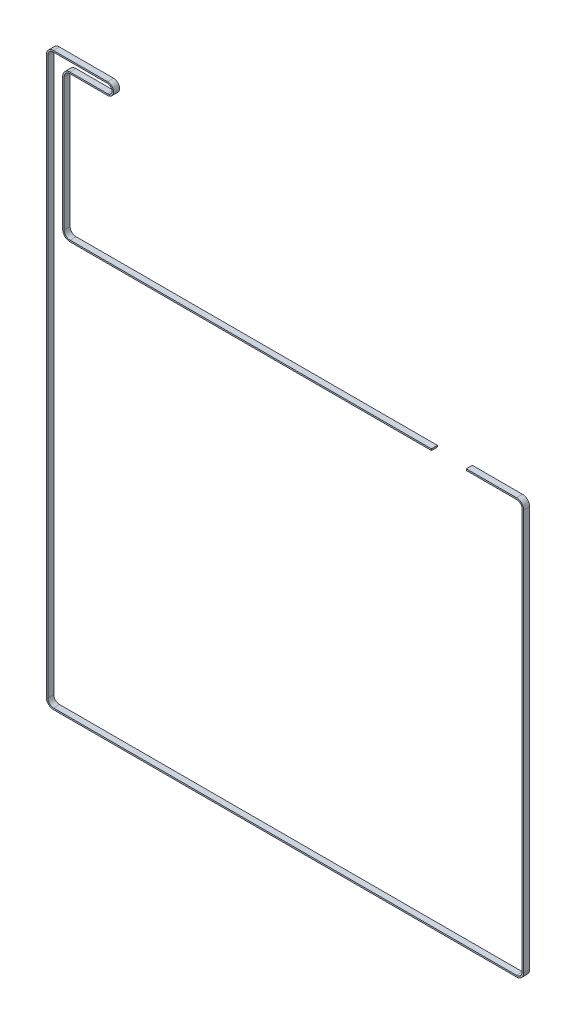
ISO-10303-21;
HEADER;
FILE_DESCRIPTION(('STEP AP214'),'2;1');
FILE_NAME('part.step','',(''),(''),'','','');
FILE_SCHEMA(('AUTOMOTIVE_DESIGN { 1 0 10303 214 1 1 1 1 }'));
ENDSEC;
DATA;
#1=APPLICATION_CONTEXT('core data for automotive mechanical design processes');
#2=APPLICATION_PROTOCOL_DEFINITION('international standard','automotive_design',2000,#1);
#3=PRODUCT_CONTEXT('',#1,'mechanical');
#4=PRODUCT('Part','Part','',(#3));
#5=PRODUCT_RELATED_PRODUCT_CATEGORY('part','',(#4));
#6=PRODUCT_DEFINITION_FORMATION('','',#4);
#7=PRODUCT_DEFINITION_CONTEXT('part definition',#1,'design');
#8=PRODUCT_DEFINITION('design','',#6,#7);
#9=PRODUCT_DEFINITION_SHAPE('','',#8);
#10=(LENGTH_UNIT() NAMED_UNIT(*) SI_UNIT(.MILLI.,.METRE.));
#11=(NAMED_UNIT(*) PLANE_ANGLE_UNIT() SI_UNIT($,.RADIAN.));
#12=(NAMED_UNIT(*) SI_UNIT($,.STERADIAN.) SOLID_ANGLE_UNIT());
#13=UNCERTAINTY_MEASURE_WITH_UNIT(LENGTH_MEASURE(1.E-05),#10,'distance_accuracy_value','');
#14=(GEOMETRIC_REPRESENTATION_CONTEXT(3) GLOBAL_UNCERTAINTY_ASSIGNED_CONTEXT((#13)) GLOBAL_UNIT_ASSIGNED_CONTEXT((#10,
#11,#12)) REPRESENTATION_CONTEXT('',''));
#15=CARTESIAN_POINT('',(0.,0.,0.));
#16=DIRECTION('',(0.,0.,1.));
#17=DIRECTION('',(1.,0.,0.));
#18=AXIS2_PLACEMENT_3D('',#15,#16,#17);
#19=CARTESIAN_POINT('',(370.637232088485,-0.149999999965927,0.));
#20=DIRECTION('',(-1.,0.,0.));
#21=DIRECTION('',(0.,0.,1.));
#22=AXIS2_PLACEMENT_3D('',#19,#20,#21);
#23=PLANE('',#22);
#24=DIRECTION('',(0.,0.,1.));
#25=VECTOR('',#24,1.);
#26=CARTESIAN_POINT('',(370.637232088485,-103.690118889299,1.45000000000001));
#27=LINE('',#26,#25);
#28=CARTESIAN_POINT('',(370.637232088485,-103.690118889299,1.45000000000001));
#29=VERTEX_POINT('',#28);
#30=CARTESIAN_POINT('',(370.637232088485,-103.690118889299,7.45000000000001));
#31=VERTEX_POINT('',#30);
#32=EDGE_CURVE('E211',#29,#31,#27,.T.);
#33=ORIENTED_EDGE('',*,*,#32,.F.);
#34=DIRECTION('',(0.,1.,0.));
#35=VECTOR('',#34,1.);
#36=CARTESIAN_POINT('',(370.637232088485,-0.149999999965927,1.45000000000001));
#37=LINE('',#36,#35);
#38=CARTESIAN_POINT('',(370.637232088485,-102.190118889299,1.45000000000001));
#39=VERTEX_POINT('',#38);
#40=EDGE_CURVE('E262',#39,#29,#37,.F.);
#41=ORIENTED_EDGE('',*,*,#40,.F.);
#42=DIRECTION('',(0.,0.,1.));
#43=VECTOR('',#42,1.);
#44=CARTESIAN_POINT('',(370.637232088485,-102.190118889299,1.45000000000001));
#45=LINE('',#44,#43);
#46=CARTESIAN_POINT('',(370.637232088485,-102.190118889299,7.45000000000001));
#47=VERTEX_POINT('',#46);
#48=EDGE_CURVE('E251',#47,#39,#45,.F.);
#49=ORIENTED_EDGE('',*,*,#48,.F.);
#50=DIRECTION('',(0.,1.,0.));
#51=VECTOR('',#50,1.);
#52=CARTESIAN_POINT('',(370.637232088485,-0.149999999965927,7.45000000000001));
#53=LINE('',#52,#51);
#54=EDGE_CURVE('E252',#31,#47,#53,.T.);
#55=ORIENTED_EDGE('',*,*,#54,.F.);
#56=EDGE_LOOP('',(#33,#41,#49,#55));
#57=FACE_BOUND('',#56,.T.);
#58=ADVANCED_FACE('F17',(#57),#23,.F.);
#59=CARTESIAN_POINT('',(370.637232088485,-102.190118889299,1.45000000000001));
#60=DIRECTION('',(0.,1.,0.));
#61=DIRECTION('',(-1.,0.,0.));
#62=AXIS2_PLACEMENT_3D('',#59,#60,#61);
#63=PLANE('',#62);
#64=ORIENTED_EDGE('',*,*,#48,.T.);
#65=DIRECTION('',(-1.,0.,0.));
#66=VECTOR('',#65,1.);
#67=CARTESIAN_POINT('',(370.637232088485,-102.190118889299,1.45000000000001));
#68=LINE('',#67,#66);
#69=CARTESIAN_POINT('',(10.0000000000049,-102.190118889256,1.45000000000001));
#70=VERTEX_POINT('',#69);
#71=EDGE_CURVE('E243',#39,#70,#68,.T.);
#72=ORIENTED_EDGE('',*,*,#71,.T.);
#73=DIRECTION('',(0.,0.,-1.));
#74=VECTOR('',#73,1.);
#75=CARTESIAN_POINT('',(10.0000000000084,-102.190118889211,4.45000000000001));
#76=LINE('',#75,#74);
#77=CARTESIAN_POINT('',(10.0000000000049,-102.190118889256,7.45000000000001));
#78=VERTEX_POINT('',#77);
#79=EDGE_CURVE('E208',#70,#78,#76,.F.);
#80=ORIENTED_EDGE('',*,*,#79,.T.);
#81=DIRECTION('',(-1.,0.,0.));
#82=VECTOR('',#81,1.);
#83=CARTESIAN_POINT('',(370.637232088485,-102.190118889299,7.45000000000001));
#84=LINE('',#83,#82);
#85=EDGE_CURVE('E248',#78,#47,#84,.F.);
#86=ORIENTED_EDGE('',*,*,#85,.T.);
#87=EDGE_LOOP('',(#64,#72,#80,#86));
#88=FACE_BOUND('',#87,.T.);
#89=ADVANCED_FACE('F375',(#88),#63,.T.);
#90=CARTESIAN_POINT('',(370.637232088485,-103.690118889299,1.45000000000001));
#91=DIRECTION('',(0.,-1.,0.));
#92=DIRECTION('',(1.,0.,0.));
#93=AXIS2_PLACEMENT_3D('',#90,#91,#92);
#94=PLANE('',#93);
#95=DIRECTION('',(1.,0.,0.));
#96=VECTOR('',#95,1.);
#97=CARTESIAN_POINT('',(370.637232088485,-103.690118889299,1.45000000000001));
#98=LINE('',#97,#96);
#99=CARTESIAN_POINT('',(10.0000000000049,-103.690118889256,1.45000000000001));
#100=VERTEX_POINT('',#99);
#101=EDGE_CURVE('E235',#100,#29,#98,.T.);
#102=ORIENTED_EDGE('',*,*,#101,.T.);
#103=ORIENTED_EDGE('',*,*,#32,.T.);
#104=DIRECTION('',(1.,0.,0.));
#105=VECTOR('',#104,1.);
#106=CARTESIAN_POINT('',(370.637232088485,-103.690118889299,7.45000000000001));
#107=LINE('',#106,#105);
#108=CARTESIAN_POINT('',(10.0000000000049,-103.690118889256,7.45000000000001));
#109=VERTEX_POINT('',#108);
#110=EDGE_CURVE('E238',#31,#109,#107,.F.);
#111=ORIENTED_EDGE('',*,*,#110,.T.);
#112=DIRECTION('',(0.,0.,-1.));
#113=VECTOR('',#112,1.);
#114=CARTESIAN_POINT('',(10.0000000000084,-103.690118889211,4.45000000000001));
#115=LINE('',#114,#113);
#116=EDGE_CURVE('E226',#100,#109,#115,.F.);
#117=ORIENTED_EDGE('',*,*,#116,.F.);
#118=EDGE_LOOP('',(#102,#103,#111,#117));
#119=FACE_BOUND('',#118,.T.);
#120=ADVANCED_FACE('F590',(#119),#94,.T.);
#121=CARTESIAN_POINT('',(10.0000000000014,-96.3401188893325,4.45000000000001));
#122=DIRECTION('',(0.,0.,-1.));
#123=DIRECTION('',(-1.,0.,0.));
#124=AXIS2_PLACEMENT_3D('',#121,#122,#123);
#125=CYLINDRICAL_SURFACE('',#124,5.84999999987856);
#126=CARTESIAN_POINT('',(10.0000000000014,-96.3401188893325,7.45000000000001));
#127=DIRECTION('',(0.,0.,-1.));
#128=DIRECTION('',(-1.,0.,0.));
#129=AXIS2_PLACEMENT_3D('',#126,#127,#128);
#130=CIRCLE('',#129,5.84999999987856);
#131=CARTESIAN_POINT('',(4.15000000006143,-96.3401188893325,7.45000000000001));
#132=VERTEX_POINT('',#131);
#133=EDGE_CURVE('E247',#78,#132,#130,.T.);
#134=ORIENTED_EDGE('',*,*,#133,.F.);
#135=ORIENTED_EDGE('',*,*,#79,.F.);
#136=CARTESIAN_POINT('',(10.0000000000014,-96.3401188893325,1.45000000000001));
#137=DIRECTION('',(0.,0.,-1.));
#138=DIRECTION('',(-1.,0.,0.));
#139=AXIS2_PLACEMENT_3D('',#136,#137,#138);
#140=CIRCLE('',#139,5.84999999987856);
#141=CARTESIAN_POINT('',(4.15000000006143,-96.3401188893326,1.45000000000001));
#142=VERTEX_POINT('',#141);
#143=EDGE_CURVE('E20',#142,#70,#140,.F.);
#144=ORIENTED_EDGE('',*,*,#143,.F.);
#145=DIRECTION('',(0.,0.,1.));
#146=VECTOR('',#145,1.);
#147=CARTESIAN_POINT('',(4.14999999999999,-96.3401188893326,1.45000000000001));
#148=LINE('',#147,#146);
#149=EDGE_CURVE('E205',#132,#142,#148,.F.);
#150=ORIENTED_EDGE('',*,*,#149,.F.);
#151=EDGE_LOOP('',(#134,#135,#144,#150));
#152=FACE_BOUND('',#151,.T.);
#153=ADVANCED_FACE('F203',(#152),#125,.F.);
#154=CARTESIAN_POINT('',(455.499999999999,-102.040118889329,1.45000000000001));
#155=DIRECTION('',(0.,1.,0.));
#156=DIRECTION('',(-1.,0.,0.));
#157=AXIS2_PLACEMENT_3D('',#154,#155,#156);
#158=PLANE('',#157);
#159=DIRECTION('',(0.,0.,1.));
#160=VECTOR('',#159,1.);
#161=CARTESIAN_POINT('',(455.50000000001,-102.04011888933,4.45000000000001));
#162=LINE('',#161,#160);
#163=CARTESIAN_POINT('',(455.500000000004,-102.040118889332,1.45000000000001));
#164=VERTEX_POINT('',#163);
#165=CARTESIAN_POINT('',(455.500000000004,-102.04011888933,7.45000000000001));
#166=VERTEX_POINT('',#165);
#167=EDGE_CURVE('E508',#164,#166,#162,.T.);
#168=ORIENTED_EDGE('',*,*,#167,.F.);
#169=DIRECTION('',(-1.,0.,0.));
#170=VECTOR('',#169,1.);
#171=CARTESIAN_POINT('',(455.499999999999,-102.040118889333,1.45000000000001));
#172=LINE('',#171,#170);
#173=CARTESIAN_POINT('',(405.337232088476,-102.040118889333,1.45000000000001));
#174=VERTEX_POINT('',#173);
#175=EDGE_CURVE('E511',#174,#164,#172,.F.);
#176=ORIENTED_EDGE('',*,*,#175,.F.);
#177=DIRECTION('',(0.,0.,1.));
#178=VECTOR('',#177,1.);
#179=CARTESIAN_POINT('',(405.337232088476,-102.040118889333,0.));
#180=LINE('',#179,#178);
#181=CARTESIAN_POINT('',(405.337232088476,-102.040118889332,7.45000000000001));
#182=VERTEX_POINT('',#181);
#183=EDGE_CURVE('E515',#182,#174,#180,.F.);
#184=ORIENTED_EDGE('',*,*,#183,.F.);
#185=DIRECTION('',(1.,0.,0.));
#186=VECTOR('',#185,1.);
#187=CARTESIAN_POINT('',(455.499999999999,-102.04011888933,7.45000000000001));
#188=LINE('',#187,#186);
#189=EDGE_CURVE('E221',#166,#182,#188,.F.);
#190=ORIENTED_EDGE('',*,*,#189,.F.);
#191=EDGE_LOOP('',(#168,#176,#184,#190));
#192=FACE_BOUND('',#191,.T.);
#193=ADVANCED_FACE('F544',(#192),#158,.T.);
#194=CARTESIAN_POINT('',(10.0000000000014,-96.3401188893325,4.45000000000001));
#195=DIRECTION('',(0.,0.,-1.));
#196=DIRECTION('',(-1.,0.,0.));
#197=AXIS2_PLACEMENT_3D('',#194,#195,#196);
#198=CYLINDRICAL_SURFACE('',#197,7.34999999987856);
#199=CARTESIAN_POINT('',(10.0000000000014,-96.3401188893325,1.45000000000001));
#200=DIRECTION('',(0.,0.,-1.));
#201=DIRECTION('',(-1.,0.,0.));
#202=AXIS2_PLACEMENT_3D('',#199,#200,#201);
#203=CIRCLE('',#202,7.34999999987856);
#204=CARTESIAN_POINT('',(2.65000000006142,-96.3401188893325,1.45000000000001));
#205=VERTEX_POINT('',#204);
#206=EDGE_CURVE('E234',#205,#100,#203,.F.);
#207=ORIENTED_EDGE('',*,*,#206,.T.);
#208=ORIENTED_EDGE('',*,*,#116,.T.);
#209=CARTESIAN_POINT('',(10.0000000000014,-96.3401188893325,7.45000000000001));
#210=DIRECTION('',(0.,0.,-1.));
#211=DIRECTION('',(-1.,0.,0.));
#212=AXIS2_PLACEMENT_3D('',#209,#210,#211);
#213=CIRCLE('',#212,7.34999999987856);
#214=CARTESIAN_POINT('',(2.65000000006142,-96.3401188893325,7.45000000000001));
#215=VERTEX_POINT('',#214);
#216=EDGE_CURVE('E365',#109,#215,#213,.T.);
#217=ORIENTED_EDGE('',*,*,#216,.T.);
#218=DIRECTION('',(0.,0.,1.));
#219=VECTOR('',#218,1.);
#220=CARTESIAN_POINT('',(2.64999999999999,-96.3401188893325,1.45000000000001));
#221=LINE('',#220,#219);
#222=EDGE_CURVE('E362',#205,#215,#221,.T.);
#223=ORIENTED_EDGE('',*,*,#222,.F.);
#224=EDGE_LOOP('',(#207,#208,#217,#223));
#225=FACE_BOUND('',#224,.T.);
#226=ADVANCED_FACE('F587',(#225),#198,.T.);
#227=CARTESIAN_POINT('',(4.14999999999999,-96.3401188893326,1.45000000000001));
#228=DIRECTION('',(1.,0.,0.));
#229=DIRECTION('',(0.,1.,0.));
#230=AXIS2_PLACEMENT_3D('',#227,#228,#229);
#231=PLANE('',#230);
#232=ORIENTED_EDGE('',*,*,#149,.T.);
#233=DIRECTION('',(0.,1.,0.));
#234=VECTOR('',#233,1.);
#235=CARTESIAN_POINT('',(4.14999999999999,-96.3401188893326,1.45000000000001));
#236=LINE('',#235,#234);
#237=CARTESIAN_POINT('',(4.14999999999998,35.6999999999999,1.45000000000001));
#238=VERTEX_POINT('',#237);
#239=EDGE_CURVE('E213',#142,#238,#236,.T.);
#240=ORIENTED_EDGE('',*,*,#239,.T.);
#241=DIRECTION('',(0.,0.,-1.));
#242=VECTOR('',#241,1.);
#243=CARTESIAN_POINT('',(4.14999999999997,35.6999999999999,4.45000000000001));
#244=LINE('',#243,#242);
#245=CARTESIAN_POINT('',(4.14999999999998,35.6999999999999,7.45000000000001));
#246=VERTEX_POINT('',#245);
#247=EDGE_CURVE('E360',#238,#246,#244,.F.);
#248=ORIENTED_EDGE('',*,*,#247,.T.);
#249=DIRECTION('',(0.,1.,0.));
#250=VECTOR('',#249,1.);
#251=CARTESIAN_POINT('',(4.14999999999999,-96.3401188893326,7.45000000000001));
#252=LINE('',#251,#250);
#253=EDGE_CURVE('E224',#246,#132,#252,.F.);
#254=ORIENTED_EDGE('',*,*,#253,.T.);
#255=EDGE_LOOP('',(#232,#240,#248,#254));
#256=FACE_BOUND('',#255,.T.);
#257=ADVANCED_FACE('F223',(#256),#231,.T.);
#258=CARTESIAN_POINT('',(405.337232088476,0.,0.));
#259=DIRECTION('',(-1.,0.,0.));
#260=DIRECTION('',(0.,0.,1.));
#261=AXIS2_PLACEMENT_3D('',#258,#259,#260);
#262=PLANE('',#261);
#263=DIRECTION('',(0.,1.,0.));
#264=VECTOR('',#263,1.);
#265=CARTESIAN_POINT('',(405.337232088476,-102.040118889329,1.45000000000001));
#266=LINE('',#265,#264);
#267=CARTESIAN_POINT('',(405.337232088476,-103.540118889333,1.45000000000001));
#268=VERTEX_POINT('',#267);
#269=EDGE_CURVE('E512',#268,#174,#266,.T.);
#270=ORIENTED_EDGE('',*,*,#269,.F.);
#271=DIRECTION('',(0.,0.,1.));
#272=VECTOR('',#271,1.);
#273=CARTESIAN_POINT('',(405.337232088476,-103.540118889333,1.45000000000001));
#274=LINE('',#273,#272);
#275=CARTESIAN_POINT('',(405.337232088476,-103.540118889333,7.45000000000001));
#276=VERTEX_POINT('',#275);
#277=EDGE_CURVE('E489',#276,#268,#274,.F.);
#278=ORIENTED_EDGE('',*,*,#277,.F.);
#279=DIRECTION('',(0.,1.,0.));
#280=VECTOR('',#279,1.);
#281=CARTESIAN_POINT('',(405.337232088476,0.,7.45000000000001));
#282=LINE('',#281,#280);
#283=EDGE_CURVE('E522',#276,#182,#282,.T.);
#284=ORIENTED_EDGE('',*,*,#283,.T.);
#285=ORIENTED_EDGE('',*,*,#183,.T.);
#286=EDGE_LOOP('',(#270,#278,#284,#285));
#287=FACE_BOUND('',#286,.T.);
#288=ADVANCED_FACE('F547',(#287),#262,.T.);
#289=CARTESIAN_POINT('',(455.499999999999,-109.165118889329,4.45000000000001));
#290=DIRECTION('',(0.,0.,1.));
#291=DIRECTION('',(1.,0.,0.));
#292=AXIS2_PLACEMENT_3D('',#289,#290,#291);
#293=CYLINDRICAL_SURFACE('',#292,7.12499999999938);
#294=DIRECTION('',(0.,0.,1.));
#295=VECTOR('',#294,1.);
#296=CARTESIAN_POINT('',(462.624999999997,-109.165118889328,1.45000000000001));
#297=LINE('',#296,#295);
#298=CARTESIAN_POINT('',(462.624999999997,-109.165118889329,1.45000000000001));
#299=VERTEX_POINT('',#298);
#300=CARTESIAN_POINT('',(462.624999999998,-109.165118889329,7.45000000000001));
#301=VERTEX_POINT('',#300);
#302=EDGE_CURVE('E349',#299,#301,#297,.T.);
#303=ORIENTED_EDGE('',*,*,#302,.F.);
#304=CARTESIAN_POINT('',(455.499999999999,-109.165118889329,1.45000000000001));
#305=DIRECTION('',(0.,0.,1.));
#306=DIRECTION('',(1.,0.,0.));
#307=AXIS2_PLACEMENT_3D('',#304,#305,#306);
#308=CIRCLE('',#307,7.12499999999938);
#309=EDGE_CURVE('E354',#164,#299,#308,.F.);
#310=ORIENTED_EDGE('',*,*,#309,.F.);
#311=ORIENTED_EDGE('',*,*,#167,.T.);
#312=CARTESIAN_POINT('',(455.499999999999,-109.165118889329,7.45000000000001));
#313=DIRECTION('',(0.,0.,1.));
#314=DIRECTION('',(1.,0.,0.));
#315=AXIS2_PLACEMENT_3D('',#312,#313,#314);
#316=CIRCLE('',#315,7.12499999999938);
#317=EDGE_CURVE('E350',#301,#166,#316,.T.);
#318=ORIENTED_EDGE('',*,*,#317,.F.);
#319=EDGE_LOOP('',(#303,#310,#311,#318));
#320=FACE_BOUND('',#319,.T.);
#321=ADVANCED_FACE('F669',(#320),#293,.T.);
#322=CARTESIAN_POINT('',(2.64999999999999,-96.3401188893325,1.45000000000001));
#323=DIRECTION('',(-1.,0.,0.));
#324=DIRECTION('',(0.,-1.,0.));
#325=AXIS2_PLACEMENT_3D('',#322,#323,#324);
#326=PLANE('',#325);
#327=DIRECTION('',(0.,-1.,0.));
#328=VECTOR('',#327,1.);
#329=CARTESIAN_POINT('',(2.64999999999999,-96.3401188893325,1.45000000000001));
#330=LINE('',#329,#328);
#331=CARTESIAN_POINT('',(2.64999999999998,35.6999999999999,1.45000000000001));
#332=VERTEX_POINT('',#331);
#333=EDGE_CURVE('E502',#332,#205,#330,.T.);
#334=ORIENTED_EDGE('',*,*,#333,.T.);
#335=ORIENTED_EDGE('',*,*,#222,.T.);
#336=DIRECTION('',(0.,-1.,0.));
#337=VECTOR('',#336,1.);
#338=CARTESIAN_POINT('',(2.64999999999999,-96.3401188893325,7.45000000000001));
#339=LINE('',#338,#337);
#340=CARTESIAN_POINT('',(2.64999999999998,35.6999999999999,7.45000000000001));
#341=VERTEX_POINT('',#340);
#342=EDGE_CURVE('E505',#215,#341,#339,.F.);
#343=ORIENTED_EDGE('',*,*,#342,.T.);
#344=DIRECTION('',(0.,0.,-1.));
#345=VECTOR('',#344,1.);
#346=CARTESIAN_POINT('',(2.64999999999997,35.6999999999999,4.45000000000001));
#347=LINE('',#346,#345);
#348=EDGE_CURVE('E345',#332,#341,#347,.F.);
#349=ORIENTED_EDGE('',*,*,#348,.F.);
#350=EDGE_LOOP('',(#334,#335,#343,#349));
#351=FACE_BOUND('',#350,.T.);
#352=ADVANCED_FACE('F584',(#351),#326,.T.);
#353=CARTESIAN_POINT('',(10.,35.6999999999999,4.45000000000001));
#354=DIRECTION('',(0.,0.,-1.));
#355=DIRECTION('',(-1.,0.,0.));
#356=AXIS2_PLACEMENT_3D('',#353,#354,#355);
#357=CYLINDRICAL_SURFACE('',#356,5.85000000000003);
#358=CARTESIAN_POINT('',(10.,35.6999999999999,7.45000000000001));
#359=DIRECTION('',(0.,0.,-1.));
#360=DIRECTION('',(-1.,0.,0.));
#361=AXIS2_PLACEMENT_3D('',#358,#359,#360);
#362=CIRCLE('',#361,5.85000000000003);
#363=CARTESIAN_POINT('',(9.99999999999998,41.5499999999999,7.45000000000001));
#364=VERTEX_POINT('',#363);
#365=EDGE_CURVE('E358',#246,#364,#362,.T.);
#366=ORIENTED_EDGE('',*,*,#365,.F.);
#367=ORIENTED_EDGE('',*,*,#247,.F.);
#368=CARTESIAN_POINT('',(10.,35.6999999999999,1.45000000000001));
#369=DIRECTION('',(0.,0.,-1.));
#370=DIRECTION('',(-1.,0.,0.));
#371=AXIS2_PLACEMENT_3D('',#368,#369,#370);
#372=CIRCLE('',#371,5.85000000000003);
#373=CARTESIAN_POINT('',(9.99999999999995,41.5499999999999,1.45000000000001));
#374=VERTEX_POINT('',#373);
#375=EDGE_CURVE('E217',#374,#238,#372,.F.);
#376=ORIENTED_EDGE('',*,*,#375,.F.);
#377=DIRECTION('',(0.,0.,1.));
#378=VECTOR('',#377,1.);
#379=CARTESIAN_POINT('',(9.9999999999999,41.5499999999999,1.45000000000001));
#380=LINE('',#379,#378);
#381=EDGE_CURVE('E478',#364,#374,#380,.F.);
#382=ORIENTED_EDGE('',*,*,#381,.F.);
#383=EDGE_LOOP('',(#366,#367,#376,#382));
#384=FACE_BOUND('',#383,.T.);
#385=ADVANCED_FACE('F663',(#384),#357,.F.);
#386=CARTESIAN_POINT('',(455.499999999999,-103.540118889329,1.45000000000001));
#387=DIRECTION('',(0.,-1.,0.));
#388=DIRECTION('',(1.,0.,0.));
#389=AXIS2_PLACEMENT_3D('',#386,#387,#388);
#390=PLANE('',#389);
#391=DIRECTION('',(1.,0.,0.));
#392=VECTOR('',#391,1.);
#393=CARTESIAN_POINT('',(455.499999999999,-103.540118889329,1.45000000000001));
#394=LINE('',#393,#392);
#395=CARTESIAN_POINT('',(455.500000000004,-103.540118889329,1.45000000000001));
#396=VERTEX_POINT('',#395);
#397=EDGE_CURVE('E353',#268,#396,#394,.T.);
#398=ORIENTED_EDGE('',*,*,#397,.T.);
#399=DIRECTION('',(0.,0.,1.));
#400=VECTOR('',#399,1.);
#401=CARTESIAN_POINT('',(455.50000000001,-103.54011888933,4.45000000000001));
#402=LINE('',#401,#400);
#403=CARTESIAN_POINT('',(455.500000000004,-103.540118889329,7.45000000000001));
#404=VERTEX_POINT('',#403);
#405=EDGE_CURVE('E338',#396,#404,#402,.T.);
#406=ORIENTED_EDGE('',*,*,#405,.T.);
#407=DIRECTION('',(1.,0.,0.));
#408=VECTOR('',#407,1.);
#409=CARTESIAN_POINT('',(455.499999999999,-103.540118889329,7.45000000000001));
#410=LINE('',#409,#408);
#411=EDGE_CURVE('E357',#404,#276,#410,.F.);
#412=ORIENTED_EDGE('',*,*,#411,.T.);
#413=ORIENTED_EDGE('',*,*,#277,.T.);
#414=EDGE_LOOP('',(#398,#406,#412,#413));
#415=FACE_BOUND('',#414,.T.);
#416=ADVANCED_FACE('F551',(#415),#390,.T.);
#417=CARTESIAN_POINT('',(462.624999999999,-509.,1.45000000000001));
#418=DIRECTION('',(1.,0.,0.));
#419=DIRECTION('',(0.,1.,0.));
#420=AXIS2_PLACEMENT_3D('',#417,#418,#419);
#421=PLANE('',#420);
#422=DIRECTION('',(0.,0.,1.));
#423=VECTOR('',#422,1.);
#424=CARTESIAN_POINT('',(462.624999999999,-508.999999999999,4.45000000000001));
#425=LINE('',#424,#423);
#426=CARTESIAN_POINT('',(462.624999999998,-508.999999999999,1.45000000000001));
#427=VERTEX_POINT('',#426);
#428=CARTESIAN_POINT('',(462.624999999999,-508.999999999999,7.45000000000001));
#429=VERTEX_POINT('',#428);
#430=EDGE_CURVE('E468',#427,#429,#425,.T.);
#431=ORIENTED_EDGE('',*,*,#430,.F.);
#432=DIRECTION('',(0.,1.,0.));
#433=VECTOR('',#432,1.);
#434=CARTESIAN_POINT('',(462.624999999997,-509.,1.45000000000001));
#435=LINE('',#434,#433);
#436=EDGE_CURVE('E337',#299,#427,#435,.F.);
#437=ORIENTED_EDGE('',*,*,#436,.F.);
#438=ORIENTED_EDGE('',*,*,#302,.T.);
#439=DIRECTION('',(0.,1.,0.));
#440=VECTOR('',#439,1.);
#441=CARTESIAN_POINT('',(462.624999999999,-509.,7.45000000000001));
#442=LINE('',#441,#440);
#443=EDGE_CURVE('E341',#429,#301,#442,.T.);
#444=ORIENTED_EDGE('',*,*,#443,.F.);
#445=EDGE_LOOP('',(#431,#437,#438,#444));
#446=FACE_BOUND('',#445,.T.);
#447=ADVANCED_FACE('F657',(#446),#421,.T.);
#448=CARTESIAN_POINT('',(10.,35.6999999999999,4.45000000000001));
#449=DIRECTION('',(0.,0.,-1.));
#450=DIRECTION('',(-1.,0.,0.));
#451=AXIS2_PLACEMENT_3D('',#448,#449,#450);
#452=CYLINDRICAL_SURFACE('',#451,7.35000000000003);
#453=CARTESIAN_POINT('',(10.,35.6999999999999,1.45000000000001));
#454=DIRECTION('',(0.,0.,-1.));
#455=DIRECTION('',(-1.,0.,0.));
#456=AXIS2_PLACEMENT_3D('',#453,#454,#455);
#457=CIRCLE('',#456,7.35000000000003);
#458=CARTESIAN_POINT('',(9.99999999999998,43.0499999999999,1.45000000000001));
#459=VERTEX_POINT('',#458);
#460=EDGE_CURVE('E342',#459,#332,#457,.F.);
#461=ORIENTED_EDGE('',*,*,#460,.T.);
#462=ORIENTED_EDGE('',*,*,#348,.T.);
#463=CARTESIAN_POINT('',(10.,35.6999999999999,7.45000000000001));
#464=DIRECTION('',(0.,0.,-1.));
#465=DIRECTION('',(-1.,0.,0.));
#466=AXIS2_PLACEMENT_3D('',#463,#464,#465);
#467=CIRCLE('',#466,7.35000000000003);
#468=CARTESIAN_POINT('',(10.,43.0499999999999,7.45000000000001));
#469=VERTEX_POINT('',#468);
#470=EDGE_CURVE('E346',#341,#469,#467,.T.);
#471=ORIENTED_EDGE('',*,*,#470,.T.);
#472=DIRECTION('',(0.,0.,1.));
#473=VECTOR('',#472,1.);
#474=CARTESIAN_POINT('',(10.0000000000001,43.0499999999999,1.45000000000001));
#475=LINE('',#474,#473);
#476=EDGE_CURVE('E459',#459,#469,#475,.T.);
#477=ORIENTED_EDGE('',*,*,#476,.F.);
#478=EDGE_LOOP('',(#461,#462,#471,#477));
#479=FACE_BOUND('',#478,.T.);
#480=ADVANCED_FACE('F581',(#479),#452,.T.);
#481=CARTESIAN_POINT('',(9.9999999999999,41.5499999999999,1.45000000000001));
#482=DIRECTION('',(0.,-1.,0.));
#483=DIRECTION('',(1.,0.,0.));
#484=AXIS2_PLACEMENT_3D('',#481,#482,#483);
#485=PLANE('',#484);
#486=ORIENTED_EDGE('',*,*,#381,.T.);
#487=DIRECTION('',(1.,0.,0.));
#488=VECTOR('',#487,1.);
#489=CARTESIAN_POINT('',(9.9999999999999,41.5499999999999,1.45000000000001));
#490=LINE('',#489,#488);
#491=CARTESIAN_POINT('',(47.5,41.5499999999999,1.45000000000001));
#492=VERTEX_POINT('',#491);
#493=EDGE_CURVE('E479',#374,#492,#490,.T.);
#494=ORIENTED_EDGE('',*,*,#493,.T.);
#495=DIRECTION('',(0.,0.,1.));
#496=VECTOR('',#495,1.);
#497=CARTESIAN_POINT('',(47.4999999999999,41.5499999999999,4.45000000000001));
#498=LINE('',#497,#496);
#499=CARTESIAN_POINT('',(47.5,41.5499999999999,7.45000000000001));
#500=VERTEX_POINT('',#499);
#501=EDGE_CURVE('E334',#500,#492,#498,.F.);
#502=ORIENTED_EDGE('',*,*,#501,.F.);
#503=DIRECTION('',(1.,0.,0.));
#504=VECTOR('',#503,1.);
#505=CARTESIAN_POINT('',(9.9999999999999,41.5499999999999,7.45000000000001));
#506=LINE('',#505,#504);
#507=EDGE_CURVE('E475',#500,#364,#506,.F.);
#508=ORIENTED_EDGE('',*,*,#507,.T.);
#509=EDGE_LOOP('',(#486,#494,#502,#508));
#510=FACE_BOUND('',#509,.T.);
#511=ADVANCED_FACE('F651',(#510),#485,.T.);
#512=CARTESIAN_POINT('',(455.499999999999,-109.165118889329,4.45000000000001));
#513=DIRECTION('',(0.,0.,1.));
#514=DIRECTION('',(1.,0.,0.));
#515=AXIS2_PLACEMENT_3D('',#512,#513,#514);
#516=CYLINDRICAL_SURFACE('',#515,5.62499999999938);
#517=ORIENTED_EDGE('',*,*,#405,.F.);
#518=CARTESIAN_POINT('',(455.499999999999,-109.165118889329,1.45000000000001));
#519=DIRECTION('',(0.,0.,1.));
#520=DIRECTION('',(1.,0.,0.));
#521=AXIS2_PLACEMENT_3D('',#518,#519,#520);
#522=CIRCLE('',#521,5.62499999999938);
#523=CARTESIAN_POINT('',(461.124999999997,-109.165118889329,1.45000000000001));
#524=VERTEX_POINT('',#523);
#525=EDGE_CURVE('E339',#524,#396,#522,.T.);
#526=ORIENTED_EDGE('',*,*,#525,.F.);
#527=DIRECTION('',(0.,0.,1.));
#528=VECTOR('',#527,1.);
#529=CARTESIAN_POINT('',(461.124999999997,-109.165118889328,1.45000000000001));
#530=LINE('',#529,#528);
#531=CARTESIAN_POINT('',(461.124999999997,-109.165118889329,7.45000000000001));
#532=VERTEX_POINT('',#531);
#533=EDGE_CURVE('E452',#532,#524,#530,.F.);
#534=ORIENTED_EDGE('',*,*,#533,.F.);
#535=CARTESIAN_POINT('',(455.499999999999,-109.165118889329,7.45000000000001));
#536=DIRECTION('',(0.,0.,1.));
#537=DIRECTION('',(1.,0.,0.));
#538=AXIS2_PLACEMENT_3D('',#535,#536,#537);
#539=CIRCLE('',#538,5.62499999999938);
#540=EDGE_CURVE('E335',#404,#532,#539,.F.);
#541=ORIENTED_EDGE('',*,*,#540,.F.);
#542=EDGE_LOOP('',(#517,#526,#534,#541));
#543=FACE_BOUND('',#542,.T.);
#544=ADVANCED_FACE('F556',(#543),#516,.F.);
#545=CARTESIAN_POINT('',(455.499999999998,-508.999999999999,4.45000000000001));
#546=DIRECTION('',(0.,0.,1.));
#547=DIRECTION('',(1.,0.,0.));
#548=AXIS2_PLACEMENT_3D('',#545,#546,#547);
#549=CYLINDRICAL_SURFACE('',#548,7.12500000000083);
#550=DIRECTION('',(0.,0.,1.));
#551=VECTOR('',#550,1.);
#552=CARTESIAN_POINT('',(455.499999999998,-516.125,1.45000000000001));
#553=LINE('',#552,#551);
#554=CARTESIAN_POINT('',(455.499999999998,-516.125,1.45000000000001));
#555=VERTEX_POINT('',#554);
#556=CARTESIAN_POINT('',(455.499999999998,-516.125000000001,7.45000000000001));
#557=VERTEX_POINT('',#556);
#558=EDGE_CURVE('E325',#555,#557,#553,.T.);
#559=ORIENTED_EDGE('',*,*,#558,.F.);
#560=CARTESIAN_POINT('',(455.499999999998,-508.999999999999,1.45000000000001));
#561=DIRECTION('',(0.,0.,1.));
#562=DIRECTION('',(1.,0.,0.));
#563=AXIS2_PLACEMENT_3D('',#560,#561,#562);
#564=CIRCLE('',#563,7.12500000000083);
#565=EDGE_CURVE('E330',#427,#555,#564,.F.);
#566=ORIENTED_EDGE('',*,*,#565,.F.);
#567=ORIENTED_EDGE('',*,*,#430,.T.);
#568=CARTESIAN_POINT('',(455.499999999998,-508.999999999999,7.45000000000001));
#569=DIRECTION('',(0.,0.,1.));
#570=DIRECTION('',(1.,0.,0.));
#571=AXIS2_PLACEMENT_3D('',#568,#569,#570);
#572=CIRCLE('',#571,7.12500000000083);
#573=EDGE_CURVE('E326',#557,#429,#572,.T.);
#574=ORIENTED_EDGE('',*,*,#573,.F.);
#575=EDGE_LOOP('',(#559,#566,#567,#574));
#576=FACE_BOUND('',#575,.T.);
#577=ADVANCED_FACE('F645',(#576),#549,.T.);
#578=CARTESIAN_POINT('',(10.0000000000001,43.0499999999999,1.45000000000001));
#579=DIRECTION('',(0.,1.,0.));
#580=DIRECTION('',(-1.,0.,0.));
#581=AXIS2_PLACEMENT_3D('',#578,#579,#580);
#582=PLANE('',#581);
#583=DIRECTION('',(-1.,0.,0.));
#584=VECTOR('',#583,1.);
#585=CARTESIAN_POINT('',(10.0000000000001,43.0499999999999,1.45000000000001));
#586=LINE('',#585,#584);
#587=CARTESIAN_POINT('',(47.5000000000001,43.0499999999999,1.45000000000001));
#588=VERTEX_POINT('',#587);
#589=EDGE_CURVE('E462',#588,#459,#586,.T.);
#590=ORIENTED_EDGE('',*,*,#589,.T.);
#591=ORIENTED_EDGE('',*,*,#476,.T.);
#592=DIRECTION('',(-1.,0.,0.));
#593=VECTOR('',#592,1.);
#594=CARTESIAN_POINT('',(10.0000000000001,43.0499999999999,7.45000000000001));
#595=LINE('',#594,#593);
#596=CARTESIAN_POINT('',(47.5,43.0499999999999,7.45000000000001));
#597=VERTEX_POINT('',#596);
#598=EDGE_CURVE('E465',#469,#597,#595,.F.);
#599=ORIENTED_EDGE('',*,*,#598,.T.);
#600=DIRECTION('',(0.,0.,1.));
#601=VECTOR('',#600,1.);
#602=CARTESIAN_POINT('',(47.5000000000001,43.0499999999999,4.45000000000001));
#603=LINE('',#602,#601);
#604=EDGE_CURVE('E321',#597,#588,#603,.F.);
#605=ORIENTED_EDGE('',*,*,#604,.T.);
#606=EDGE_LOOP('',(#590,#591,#599,#605));
#607=FACE_BOUND('',#606,.T.);
#608=ADVANCED_FACE('F578',(#607),#582,.T.);
#609=CARTESIAN_POINT('',(47.5000000000001,47.4999999999999,4.45000000000001));
#610=DIRECTION('',(0.,0.,1.));
#611=DIRECTION('',(1.,0.,0.));
#612=AXIS2_PLACEMENT_3D('',#609,#610,#611);
#613=CYLINDRICAL_SURFACE('',#612,5.94999999999998);
#614=DIRECTION('',(0.,0.,1.));
#615=VECTOR('',#614,1.);
#616=CARTESIAN_POINT('',(47.500000000009,53.4500000000348,1.45000000000001));
#617=LINE('',#616,#615);
#618=CARTESIAN_POINT('',(47.5000000000045,53.4500000000173,7.45000000000001));
#619=VERTEX_POINT('',#618);
#620=CARTESIAN_POINT('',(47.5000000000045,53.4500000000173,1.45000000000001));
#621=VERTEX_POINT('',#620);
#622=EDGE_CURVE('E320',#619,#621,#617,.F.);
#623=ORIENTED_EDGE('',*,*,#622,.F.);
#624=CARTESIAN_POINT('',(47.5000000000001,47.4999999999999,7.45000000000001));
#625=DIRECTION('',(0.,0.,1.));
#626=DIRECTION('',(1.,0.,0.));
#627=AXIS2_PLACEMENT_3D('',#624,#625,#626);
#628=CIRCLE('',#627,5.94999999999998);
#629=EDGE_CURVE('E322',#500,#619,#628,.T.);
#630=ORIENTED_EDGE('',*,*,#629,.F.);
#631=ORIENTED_EDGE('',*,*,#501,.T.);
#632=CARTESIAN_POINT('',(47.5000000000001,47.4999999999999,1.45000000000001));
#633=DIRECTION('',(0.,0.,1.));
#634=DIRECTION('',(1.,0.,0.));
#635=AXIS2_PLACEMENT_3D('',#632,#633,#634);
#636=CIRCLE('',#635,5.94999999999998);
#637=EDGE_CURVE('E317',#621,#492,#636,.F.);
#638=ORIENTED_EDGE('',*,*,#637,.F.);
#639=EDGE_LOOP('',(#623,#630,#631,#638));
#640=FACE_BOUND('',#639,.T.);
#641=ADVANCED_FACE('F639',(#640),#613,.T.);
#642=CARTESIAN_POINT('',(461.124999999999,-509.,1.45000000000001));
#643=DIRECTION('',(-1.,0.,0.));
#644=DIRECTION('',(0.,-1.,0.));
#645=AXIS2_PLACEMENT_3D('',#642,#643,#644);
#646=PLANE('',#645);
#647=DIRECTION('',(0.,-1.,0.));
#648=VECTOR('',#647,1.);
#649=CARTESIAN_POINT('',(461.124999999999,-509.,1.45000000000001));
#650=LINE('',#649,#648);
#651=CARTESIAN_POINT('',(461.124999999999,-508.999999999999,1.45000000000001));
#652=VERTEX_POINT('',#651);
#653=EDGE_CURVE('E329',#524,#652,#650,.T.);
#654=ORIENTED_EDGE('',*,*,#653,.T.);
#655=DIRECTION('',(0.,0.,1.));
#656=VECTOR('',#655,1.);
#657=CARTESIAN_POINT('',(461.124999999999,-508.999999999999,4.45000000000001));
#658=LINE('',#657,#656);
#659=CARTESIAN_POINT('',(461.124999999999,-508.999999999999,7.45000000000001));
#660=VERTEX_POINT('',#659);
#661=EDGE_CURVE('E313',#652,#660,#658,.T.);
#662=ORIENTED_EDGE('',*,*,#661,.T.);
#663=DIRECTION('',(0.,-1.,0.));
#664=VECTOR('',#663,1.);
#665=CARTESIAN_POINT('',(461.124999999999,-509.,7.45000000000001));
#666=LINE('',#665,#664);
#667=EDGE_CURVE('E333',#660,#532,#666,.F.);
#668=ORIENTED_EDGE('',*,*,#667,.T.);
#669=ORIENTED_EDGE('',*,*,#533,.T.);
#670=EDGE_LOOP('',(#654,#662,#668,#669));
#671=FACE_BOUND('',#670,.T.);
#672=ADVANCED_FACE('F559',(#671),#646,.T.);
#673=CARTESIAN_POINT('',(-6.50000000000006,-516.125000000001,1.45000000000001));
#674=DIRECTION('',(0.,-1.,0.));
#675=DIRECTION('',(1.,0.,0.));
#676=AXIS2_PLACEMENT_3D('',#673,#674,#675);
#677=PLANE('',#676);
#678=DIRECTION('',(0.,0.,1.));
#679=VECTOR('',#678,1.);
#680=CARTESIAN_POINT('',(-6.50000000000023,-516.125000000001,4.45000000000001));
#681=LINE('',#680,#679);
#682=CARTESIAN_POINT('',(-6.4999999999995,-516.125000000001,1.45000000000001));
#683=VERTEX_POINT('',#682);
#684=CARTESIAN_POINT('',(-6.4999999999995,-516.125000000001,7.45000000000001));
#685=VERTEX_POINT('',#684);
#686=EDGE_CURVE('E432',#683,#685,#681,.T.);
#687=ORIENTED_EDGE('',*,*,#686,.F.);
#688=DIRECTION('',(-1.,0.,0.));
#689=VECTOR('',#688,1.);
#690=CARTESIAN_POINT('',(-6.50000000000006,-516.125,1.45000000000001));
#691=LINE('',#690,#689);
#692=EDGE_CURVE('E312',#555,#683,#691,.T.);
#693=ORIENTED_EDGE('',*,*,#692,.F.);
#694=ORIENTED_EDGE('',*,*,#558,.T.);
#695=DIRECTION('',(1.,0.,0.));
#696=VECTOR('',#695,1.);
#697=CARTESIAN_POINT('',(-6.50000000000006,-516.125000000001,7.45000000000001));
#698=LINE('',#697,#696);
#699=EDGE_CURVE('E316',#685,#557,#698,.T.);
#700=ORIENTED_EDGE('',*,*,#699,.F.);
#701=EDGE_LOOP('',(#687,#693,#694,#700));
#702=FACE_BOUND('',#701,.T.);
#703=ADVANCED_FACE('F632',(#702),#677,.T.);
#704=CARTESIAN_POINT('',(47.500000000009,53.4500000000348,1.45000000000001));
#705=DIRECTION('',(0.,1.,0.));
#706=DIRECTION('',(-1.,0.,0.));
#707=AXIS2_PLACEMENT_3D('',#704,#705,#706);
#708=PLANE('',#707);
#709=ORIENTED_EDGE('',*,*,#622,.T.);
#710=DIRECTION('',(-1.,0.,0.));
#711=VECTOR('',#710,1.);
#712=CARTESIAN_POINT('',(47.500000000009,53.4500000000347,1.45000000000001));
#713=LINE('',#712,#711);
#714=CARTESIAN_POINT('',(-6.49999999999556,53.4500000000348,1.45000000000001));
#715=VERTEX_POINT('',#714);
#716=EDGE_CURVE('E309',#715,#621,#713,.F.);
#717=ORIENTED_EDGE('',*,*,#716,.F.);
#718=DIRECTION('',(0.,0.,1.));
#719=VECTOR('',#718,1.);
#720=CARTESIAN_POINT('',(-6.49999999999112,53.4500000000349,4.45000000000001));
#721=LINE('',#720,#719);
#722=CARTESIAN_POINT('',(-6.49999999999556,53.4500000000174,7.45000000000001));
#723=VERTEX_POINT('',#722);
#724=EDGE_CURVE('E304',#723,#715,#721,.F.);
#725=ORIENTED_EDGE('',*,*,#724,.F.);
#726=DIRECTION('',(1.,0.,0.));
#727=VECTOR('',#726,1.);
#728=CARTESIAN_POINT('',(47.500000000009,53.4499999999999,7.45000000000001));
#729=LINE('',#728,#727);
#730=EDGE_CURVE('E435',#619,#723,#729,.F.);
#731=ORIENTED_EDGE('',*,*,#730,.F.);
#732=EDGE_LOOP('',(#709,#717,#725,#731));
#733=FACE_BOUND('',#732,.T.);
#734=ADVANCED_FACE('F629',(#733),#708,.T.);
#735=CARTESIAN_POINT('',(455.499999999998,-508.999999999999,4.45000000000001));
#736=DIRECTION('',(0.,0.,1.));
#737=DIRECTION('',(1.,0.,0.));
#738=AXIS2_PLACEMENT_3D('',#735,#736,#737);
#739=CYLINDRICAL_SURFACE('',#738,5.62500000000088);
#740=ORIENTED_EDGE('',*,*,#661,.F.);
#741=CARTESIAN_POINT('',(455.499999999998,-508.999999999999,1.45000000000001));
#742=DIRECTION('',(0.,0.,1.));
#743=DIRECTION('',(1.,0.,0.));
#744=AXIS2_PLACEMENT_3D('',#741,#742,#743);
#745=CIRCLE('',#744,5.62500000000088);
#746=CARTESIAN_POINT('',(455.499999999998,-514.625,1.45000000000001));
#747=VERTEX_POINT('',#746);
#748=EDGE_CURVE('E314',#747,#652,#745,.T.);
#749=ORIENTED_EDGE('',*,*,#748,.F.);
#750=DIRECTION('',(0.,0.,1.));
#751=VECTOR('',#750,1.);
#752=CARTESIAN_POINT('',(455.499999999998,-514.625,1.45000000000001));
#753=LINE('',#752,#751);
#754=CARTESIAN_POINT('',(455.499999999998,-514.625,7.45000000000001));
#755=VERTEX_POINT('',#754);
#756=EDGE_CURVE('E424',#755,#747,#753,.F.);
#757=ORIENTED_EDGE('',*,*,#756,.F.);
#758=CARTESIAN_POINT('',(455.499999999998,-508.999999999999,7.45000000000001));
#759=DIRECTION('',(0.,0.,1.));
#760=DIRECTION('',(1.,0.,0.));
#761=AXIS2_PLACEMENT_3D('',#758,#759,#760);
#762=CIRCLE('',#761,5.62500000000088);
#763=EDGE_CURVE('E310',#660,#755,#762,.F.);
#764=ORIENTED_EDGE('',*,*,#763,.F.);
#765=EDGE_LOOP('',(#740,#749,#757,#764));
#766=FACE_BOUND('',#765,.T.);
#767=ADVANCED_FACE('F564',(#766),#739,.F.);
#768=CARTESIAN_POINT('',(-6.49999999999877,-509.,4.45000000000001));
#769=DIRECTION('',(0.,0.,1.));
#770=DIRECTION('',(1.,0.,0.));
#771=AXIS2_PLACEMENT_3D('',#768,#769,#770);
#772=CYLINDRICAL_SURFACE('',#771,7.12500000000134);
#773=DIRECTION('',(0.,0.,1.));
#774=VECTOR('',#773,1.);
#775=CARTESIAN_POINT('',(-13.625,-509.,1.45000000000001));
#776=LINE('',#775,#774);
#777=CARTESIAN_POINT('',(-13.625,-509.,1.45000000000001));
#778=VERTEX_POINT('',#777);
#779=CARTESIAN_POINT('',(-13.6250000000175,-509.,7.45000000000001));
#780=VERTEX_POINT('',#779);
#781=EDGE_CURVE('E298',#778,#780,#776,.T.);
#782=ORIENTED_EDGE('',*,*,#781,.F.);
#783=CARTESIAN_POINT('',(-6.49999999999877,-509.,1.45000000000001));
#784=DIRECTION('',(0.,0.,1.));
#785=DIRECTION('',(1.,0.,0.));
#786=AXIS2_PLACEMENT_3D('',#783,#784,#785);
#787=CIRCLE('',#786,7.12500000000134);
#788=EDGE_CURVE('E300',#683,#778,#787,.F.);
#789=ORIENTED_EDGE('',*,*,#788,.F.);
#790=ORIENTED_EDGE('',*,*,#686,.T.);
#791=CARTESIAN_POINT('',(-6.49999999999877,-509.,7.45000000000001));
#792=DIRECTION('',(0.,0.,1.));
#793=DIRECTION('',(1.,0.,0.));
#794=AXIS2_PLACEMENT_3D('',#791,#792,#793);
#795=CIRCLE('',#794,7.12500000000134);
#796=EDGE_CURVE('E295',#780,#685,#795,.T.);
#797=ORIENTED_EDGE('',*,*,#796,.F.);
#798=EDGE_LOOP('',(#782,#789,#790,#797));
#799=FACE_BOUND('',#798,.T.);
#800=ADVANCED_FACE('F623',(#799),#772,.T.);
#801=CARTESIAN_POINT('',(47.5000000000001,47.4999999999999,4.45000000000001));
#802=DIRECTION('',(0.,0.,1.));
#803=DIRECTION('',(1.,0.,0.));
#804=AXIS2_PLACEMENT_3D('',#801,#802,#803);
#805=CYLINDRICAL_SURFACE('',#804,4.44999999999998);
#806=CARTESIAN_POINT('',(47.5000000000001,47.4999999999999,1.45000000000001));
#807=DIRECTION('',(0.,0.,1.));
#808=DIRECTION('',(1.,0.,0.));
#809=AXIS2_PLACEMENT_3D('',#806,#807,#808);
#810=CIRCLE('',#809,4.44999999999998);
#811=CARTESIAN_POINT('',(47.5000000000045,51.9500000000173,1.45000000000001));
#812=VERTEX_POINT('',#811);
#813=EDGE_CURVE('E305',#588,#812,#810,.T.);
#814=ORIENTED_EDGE('',*,*,#813,.F.);
#815=ORIENTED_EDGE('',*,*,#604,.F.);
#816=CARTESIAN_POINT('',(47.5000000000001,47.4999999999999,7.45000000000001));
#817=DIRECTION('',(0.,0.,1.));
#818=DIRECTION('',(1.,0.,0.));
#819=AXIS2_PLACEMENT_3D('',#816,#817,#818);
#820=CIRCLE('',#819,4.44999999999998);
#821=CARTESIAN_POINT('',(47.5000000000045,51.9500000000173,7.45000000000001));
#822=VERTEX_POINT('',#821);
#823=EDGE_CURVE('E307',#822,#597,#820,.F.);
#824=ORIENTED_EDGE('',*,*,#823,.F.);
#825=DIRECTION('',(0.,0.,1.));
#826=VECTOR('',#825,1.);
#827=CARTESIAN_POINT('',(47.500000000009,51.9500000000348,1.45000000000001));
#828=LINE('',#827,#826);
#829=EDGE_CURVE('E294',#812,#822,#828,.T.);
#830=ORIENTED_EDGE('',*,*,#829,.F.);
#831=EDGE_LOOP('',(#814,#815,#824,#830));
#832=FACE_BOUND('',#831,.T.);
#833=ADVANCED_FACE('F576',(#832),#805,.F.);
#834=CARTESIAN_POINT('',(-6.49999999999999,46.3249999999999,4.45000000000001));
#835=DIRECTION('',(0.,0.,1.));
#836=DIRECTION('',(1.,0.,0.));
#837=AXIS2_PLACEMENT_3D('',#834,#835,#836);
#838=CYLINDRICAL_SURFACE('',#837,7.12500000003506);
#839=ORIENTED_EDGE('',*,*,#724,.T.);
#840=CARTESIAN_POINT('',(-6.49999999999999,46.3249999999999,1.45000000000001));
#841=DIRECTION('',(0.,0.,1.));
#842=DIRECTION('',(1.,0.,0.));
#843=AXIS2_PLACEMENT_3D('',#840,#841,#842);
#844=CIRCLE('',#843,7.12500000003506);
#845=CARTESIAN_POINT('',(-13.6250000000175,46.3249999999999,1.45000000000001));
#846=VERTEX_POINT('',#845);
#847=EDGE_CURVE('E291',#846,#715,#844,.F.);
#848=ORIENTED_EDGE('',*,*,#847,.F.);
#849=DIRECTION('',(0.,0.,1.));
#850=VECTOR('',#849,1.);
#851=CARTESIAN_POINT('',(-13.625,46.3249999999999,1.45000000000001));
#852=LINE('',#851,#850);
#853=CARTESIAN_POINT('',(-13.6250000000175,46.3249999999998,7.45000000000001));
#854=VERTEX_POINT('',#853);
#855=EDGE_CURVE('E413',#854,#846,#852,.F.);
#856=ORIENTED_EDGE('',*,*,#855,.F.);
#857=CARTESIAN_POINT('',(-6.49999999999999,46.3249999999999,7.45000000000001));
#858=DIRECTION('',(0.,0.,1.));
#859=DIRECTION('',(1.,0.,0.));
#860=AXIS2_PLACEMENT_3D('',#857,#858,#859);
#861=CIRCLE('',#860,7.12500000003506);
#862=EDGE_CURVE('E288',#723,#854,#861,.T.);
#863=ORIENTED_EDGE('',*,*,#862,.F.);
#864=EDGE_LOOP('',(#839,#848,#856,#863));
#865=FACE_BOUND('',#864,.T.);
#866=ADVANCED_FACE('F617',(#865),#838,.T.);
#867=CARTESIAN_POINT('',(-6.49999999999995,-514.625000000001,1.45000000000001));
#868=DIRECTION('',(0.,1.,0.));
#869=DIRECTION('',(-1.,0.,0.));
#870=AXIS2_PLACEMENT_3D('',#867,#868,#869);
#871=PLANE('',#870);
#872=DIRECTION('',(-1.,0.,0.));
#873=VECTOR('',#872,1.);
#874=CARTESIAN_POINT('',(-6.49999999999995,-514.625000000001,1.45000000000001));
#875=LINE('',#874,#873);
#876=CARTESIAN_POINT('',(-6.49999999999927,-514.625000000001,1.45000000000001));
#877=VERTEX_POINT('',#876);
#878=EDGE_CURVE('E299',#747,#877,#875,.T.);
#879=ORIENTED_EDGE('',*,*,#878,.T.);
#880=DIRECTION('',(0.,0.,1.));
#881=VECTOR('',#880,1.);
#882=CARTESIAN_POINT('',(-6.49999999999979,-514.625000000001,4.45000000000001));
#883=LINE('',#882,#881);
#884=CARTESIAN_POINT('',(-6.49999999999927,-514.625000000001,7.45000000000001));
#885=VERTEX_POINT('',#884);
#886=EDGE_CURVE('E284',#877,#885,#883,.T.);
#887=ORIENTED_EDGE('',*,*,#886,.T.);
#888=DIRECTION('',(-1.,0.,0.));
#889=VECTOR('',#888,1.);
#890=CARTESIAN_POINT('',(-6.49999999999995,-514.625000000001,7.45000000000001));
#891=LINE('',#890,#889);
#892=EDGE_CURVE('E303',#885,#755,#891,.F.);
#893=ORIENTED_EDGE('',*,*,#892,.T.);
#894=ORIENTED_EDGE('',*,*,#756,.T.);
#895=EDGE_LOOP('',(#879,#887,#893,#894));
#896=FACE_BOUND('',#895,.T.);
#897=ADVANCED_FACE('F568',(#896),#871,.T.);
#898=CARTESIAN_POINT('',(-13.625,46.3249999999999,1.45000000000001));
#899=DIRECTION('',(-1.,0.,0.));
#900=DIRECTION('',(0.,-1.,0.));
#901=AXIS2_PLACEMENT_3D('',#898,#899,#900);
#902=PLANE('',#901);
#903=ORIENTED_EDGE('',*,*,#855,.T.);
#904=DIRECTION('',(0.,1.,0.));
#905=VECTOR('',#904,1.);
#906=CARTESIAN_POINT('',(-13.625,46.3249999999999,1.45000000000001));
#907=LINE('',#906,#905);
#908=EDGE_CURVE('E283',#778,#846,#907,.T.);
#909=ORIENTED_EDGE('',*,*,#908,.F.);
#910=ORIENTED_EDGE('',*,*,#781,.T.);
#911=DIRECTION('',(0.,1.,0.));
#912=VECTOR('',#911,1.);
#913=CARTESIAN_POINT('',(-13.625000000035,46.3249999999999,7.45000000000001));
#914=LINE('',#913,#912);
#915=EDGE_CURVE('E287',#854,#780,#914,.F.);
#916=ORIENTED_EDGE('',*,*,#915,.F.);
#917=EDGE_LOOP('',(#903,#909,#910,#916));
#918=FACE_BOUND('',#917,.T.);
#919=ADVANCED_FACE('F611',(#918),#902,.T.);
#920=CARTESIAN_POINT('',(47.500000000009,51.9500000000348,1.45000000000001));
#921=DIRECTION('',(0.,-1.,0.));
#922=DIRECTION('',(1.,0.,0.));
#923=AXIS2_PLACEMENT_3D('',#920,#921,#922);
#924=PLANE('',#923);
#925=DIRECTION('',(1.,0.,0.));
#926=VECTOR('',#925,1.);
#927=CARTESIAN_POINT('',(47.500000000009,51.9500000000348,1.45000000000001));
#928=LINE('',#927,#926);
#929=CARTESIAN_POINT('',(-6.49999999999556,51.9500000000348,1.45000000000001));
#930=VERTEX_POINT('',#929);
#931=EDGE_CURVE('E393',#930,#812,#928,.T.);
#932=ORIENTED_EDGE('',*,*,#931,.T.);
#933=ORIENTED_EDGE('',*,*,#829,.T.);
#934=DIRECTION('',(1.,0.,0.));
#935=VECTOR('',#934,1.);
#936=CARTESIAN_POINT('',(47.500000000009,51.9500000000348,7.45000000000001));
#937=LINE('',#936,#935);
#938=CARTESIAN_POINT('',(-6.49999999999556,51.9500000000348,7.45000000000001));
#939=VERTEX_POINT('',#938);
#940=EDGE_CURVE('E391',#822,#939,#937,.F.);
#941=ORIENTED_EDGE('',*,*,#940,.T.);
#942=DIRECTION('',(0.,0.,1.));
#943=VECTOR('',#942,1.);
#944=CARTESIAN_POINT('',(-6.49999999999112,51.9500000000349,4.45000000000001));
#945=LINE('',#944,#943);
#946=EDGE_CURVE('E280',#939,#930,#945,.F.);
#947=ORIENTED_EDGE('',*,*,#946,.T.);
#948=EDGE_LOOP('',(#932,#933,#941,#947));
#949=FACE_BOUND('',#948,.T.);
#950=ADVANCED_FACE('F398',(#949),#924,.T.);
#951=CARTESIAN_POINT('',(-13.625,46.3249999999999,7.45000000000001));
#952=DIRECTION('',(0.,0.,1.));
#953=DIRECTION('',(1.,0.,0.));
#954=AXIS2_PLACEMENT_3D('',#951,#952,#953);
#955=PLANE('',#954);
#956=DIRECTION('',(0.,1.,0.));
#957=VECTOR('',#956,1.);
#958=CARTESIAN_POINT('',(-12.125,46.3249999999998,7.45000000000001));
#959=LINE('',#958,#957);
#960=CARTESIAN_POINT('',(-12.1250000000175,46.3249999999998,7.45000000000001));
#961=VERTEX_POINT('',#960);
#962=CARTESIAN_POINT('',(-12.125,-509.,7.45000000000001));
#963=VERTEX_POINT('',#962);
#964=EDGE_CURVE('E278',#961,#963,#959,.F.);
#965=ORIENTED_EDGE('',*,*,#964,.F.);
#966=CARTESIAN_POINT('',(-6.49999999999999,46.3249999999999,7.45000000000001));
#967=DIRECTION('',(0.,0.,1.));
#968=DIRECTION('',(1.,0.,0.));
#969=AXIS2_PLACEMENT_3D('',#966,#967,#968);
#970=CIRCLE('',#969,5.62500000003506);
#971=EDGE_CURVE('E275',#961,#939,#970,.F.);
#972=ORIENTED_EDGE('',*,*,#971,.T.);
#973=ORIENTED_EDGE('',*,*,#940,.F.);
#974=ORIENTED_EDGE('',*,*,#823,.T.);
#975=ORIENTED_EDGE('',*,*,#598,.F.);
#976=ORIENTED_EDGE('',*,*,#470,.F.);
#977=ORIENTED_EDGE('',*,*,#342,.F.);
#978=ORIENTED_EDGE('',*,*,#216,.F.);
#979=ORIENTED_EDGE('',*,*,#110,.F.);
#980=ORIENTED_EDGE('',*,*,#54,.T.);
#981=ORIENTED_EDGE('',*,*,#85,.F.);
#982=ORIENTED_EDGE('',*,*,#133,.T.);
#983=ORIENTED_EDGE('',*,*,#253,.F.);
#984=ORIENTED_EDGE('',*,*,#365,.T.);
#985=ORIENTED_EDGE('',*,*,#507,.F.);
#986=ORIENTED_EDGE('',*,*,#629,.T.);
#987=ORIENTED_EDGE('',*,*,#730,.T.);
#988=ORIENTED_EDGE('',*,*,#862,.T.);
#989=ORIENTED_EDGE('',*,*,#915,.T.);
#990=ORIENTED_EDGE('',*,*,#796,.T.);
#991=ORIENTED_EDGE('',*,*,#699,.T.);
#992=ORIENTED_EDGE('',*,*,#573,.T.);
#993=ORIENTED_EDGE('',*,*,#443,.T.);
#994=ORIENTED_EDGE('',*,*,#317,.T.);
#995=ORIENTED_EDGE('',*,*,#189,.T.);
#996=ORIENTED_EDGE('',*,*,#283,.F.);
#997=ORIENTED_EDGE('',*,*,#411,.F.);
#998=ORIENTED_EDGE('',*,*,#540,.T.);
#999=ORIENTED_EDGE('',*,*,#667,.F.);
#1000=ORIENTED_EDGE('',*,*,#763,.T.);
#1001=ORIENTED_EDGE('',*,*,#892,.F.);
#1002=CARTESIAN_POINT('',(-6.49999999999877,-509.,7.45000000000001));
#1003=DIRECTION('',(0.,0.,1.));
#1004=DIRECTION('',(1.,0.,0.));
#1005=AXIS2_PLACEMENT_3D('',#1002,#1003,#1004);
#1006=CIRCLE('',#1005,5.62500000000134);
#1007=EDGE_CURVE('E281',#885,#963,#1006,.F.);
#1008=ORIENTED_EDGE('',*,*,#1007,.T.);
#1009=EDGE_LOOP('',(#965,#972,#973,#974,#975,#976,#977,#978,#979,#980,#981,#982,#983,#984,#985,
#986,#987,#988,#989,#990,#991,#992,#993,#994,#995,#996,#997,#998,#999,#1000,#1001,#1008));
#1010=FACE_BOUND('',#1009,.T.);
#1011=ADVANCED_FACE('F369',(#1010),#955,.T.);
#1012=CARTESIAN_POINT('',(-6.49999999999877,-509.,4.45000000000001));
#1013=DIRECTION('',(0.,0.,1.));
#1014=DIRECTION('',(1.,0.,0.));
#1015=AXIS2_PLACEMENT_3D('',#1012,#1013,#1014);
#1016=CYLINDRICAL_SURFACE('',#1015,5.62500000000134);
#1017=ORIENTED_EDGE('',*,*,#886,.F.);
#1018=CARTESIAN_POINT('',(-6.49999999999877,-509.,1.45000000000001));
#1019=DIRECTION('',(0.,0.,1.));
#1020=DIRECTION('',(1.,0.,0.));
#1021=AXIS2_PLACEMENT_3D('',#1018,#1019,#1020);
#1022=CIRCLE('',#1021,5.62500000000134);
#1023=CARTESIAN_POINT('',(-12.125,-509.,1.45000000000001));
#1024=VERTEX_POINT('',#1023);
#1025=EDGE_CURVE('E285',#1024,#877,#1022,.T.);
#1026=ORIENTED_EDGE('',*,*,#1025,.F.);
#1027=DIRECTION('',(0.,0.,1.));
#1028=VECTOR('',#1027,1.);
#1029=CARTESIAN_POINT('',(-12.125,-509.,1.45000000000001));
#1030=LINE('',#1029,#1028);
#1031=EDGE_CURVE('E409',#963,#1024,#1030,.F.);
#1032=ORIENTED_EDGE('',*,*,#1031,.F.);
#1033=ORIENTED_EDGE('',*,*,#1007,.F.);
#1034=EDGE_LOOP('',(#1017,#1026,#1032,#1033));
#1035=FACE_BOUND('',#1034,.T.);
#1036=ADVANCED_FACE('F571',(#1035),#1016,.F.);
#1037=CARTESIAN_POINT('',(-13.625,46.3249999999999,1.45000000000001));
#1038=DIRECTION('',(0.,0.,-1.));
#1039=DIRECTION('',(-1.,0.,0.));
#1040=AXIS2_PLACEMENT_3D('',#1037,#1038,#1039);
#1041=PLANE('',#1040);
#1042=ORIENTED_EDGE('',*,*,#908,.T.);
#1043=ORIENTED_EDGE('',*,*,#847,.T.);
#1044=ORIENTED_EDGE('',*,*,#716,.T.);
#1045=ORIENTED_EDGE('',*,*,#637,.T.);
#1046=ORIENTED_EDGE('',*,*,#493,.F.);
#1047=ORIENTED_EDGE('',*,*,#375,.T.);
#1048=ORIENTED_EDGE('',*,*,#239,.F.);
#1049=ORIENTED_EDGE('',*,*,#143,.T.);
#1050=ORIENTED_EDGE('',*,*,#71,.F.);
#1051=ORIENTED_EDGE('',*,*,#40,.T.);
#1052=ORIENTED_EDGE('',*,*,#101,.F.);
#1053=ORIENTED_EDGE('',*,*,#206,.F.);
#1054=ORIENTED_EDGE('',*,*,#333,.F.);
#1055=ORIENTED_EDGE('',*,*,#460,.F.);
#1056=ORIENTED_EDGE('',*,*,#589,.F.);
#1057=ORIENTED_EDGE('',*,*,#813,.T.);
#1058=ORIENTED_EDGE('',*,*,#931,.F.);
#1059=CARTESIAN_POINT('',(-6.49999999999999,46.3249999999999,1.45000000000001));
#1060=DIRECTION('',(0.,0.,1.));
#1061=DIRECTION('',(1.,0.,0.));
#1062=AXIS2_PLACEMENT_3D('',#1059,#1060,#1061);
#1063=CIRCLE('',#1062,5.62500000003506);
#1064=CARTESIAN_POINT('',(-12.1250000000175,46.3249999999998,1.45000000000001));
#1065=VERTEX_POINT('',#1064);
#1066=EDGE_CURVE('E35',#930,#1065,#1063,.T.);
#1067=ORIENTED_EDGE('',*,*,#1066,.T.);
#1068=DIRECTION('',(0.,1.,0.));
#1069=VECTOR('',#1068,1.);
#1070=CARTESIAN_POINT('',(-12.125,46.3249999999998,1.45000000000001));
#1071=LINE('',#1070,#1069);
#1072=EDGE_CURVE('E26',#1024,#1065,#1071,.T.);
#1073=ORIENTED_EDGE('',*,*,#1072,.F.);
#1074=ORIENTED_EDGE('',*,*,#1025,.T.);
#1075=ORIENTED_EDGE('',*,*,#878,.F.);
#1076=ORIENTED_EDGE('',*,*,#748,.T.);
#1077=ORIENTED_EDGE('',*,*,#653,.F.);
#1078=ORIENTED_EDGE('',*,*,#525,.T.);
#1079=ORIENTED_EDGE('',*,*,#397,.F.);
#1080=ORIENTED_EDGE('',*,*,#269,.T.);
#1081=ORIENTED_EDGE('',*,*,#175,.T.);
#1082=ORIENTED_EDGE('',*,*,#309,.T.);
#1083=ORIENTED_EDGE('',*,*,#436,.T.);
#1084=ORIENTED_EDGE('',*,*,#565,.T.);
#1085=ORIENTED_EDGE('',*,*,#692,.T.);
#1086=ORIENTED_EDGE('',*,*,#788,.T.);
#1087=EDGE_LOOP('',(#1042,#1043,#1044,#1045,#1046,#1047,#1048,#1049,#1050,#1051,#1052,#1053,
#1054,#1055,#1056,#1057,#1058,#1067,#1073,#1074,#1075,#1076,#1077,#1078,#1079,#1080,#1081,#1082,
#1083,#1084,#1085,#1086));
#1088=FACE_BOUND('',#1087,.T.);
#1089=ADVANCED_FACE('F215',(#1088),#1041,.T.);
#1090=CARTESIAN_POINT('',(-6.49999999999999,46.3249999999999,4.45000000000001));
#1091=DIRECTION('',(0.,0.,1.));
#1092=DIRECTION('',(1.,0.,0.));
#1093=AXIS2_PLACEMENT_3D('',#1090,#1091,#1092);
#1094=CYLINDRICAL_SURFACE('',#1093,5.62500000003506);
#1095=DIRECTION('',(0.,0.,1.));
#1096=VECTOR('',#1095,1.);
#1097=CARTESIAN_POINT('',(-12.125,46.3249999999998,1.45000000000001));
#1098=LINE('',#1097,#1096);
#1099=EDGE_CURVE('E11',#1065,#961,#1098,.T.);
#1100=ORIENTED_EDGE('',*,*,#1099,.F.);
#1101=ORIENTED_EDGE('',*,*,#1066,.F.);
#1102=ORIENTED_EDGE('',*,*,#946,.F.);
#1103=ORIENTED_EDGE('',*,*,#971,.F.);
#1104=EDGE_LOOP('',(#1100,#1101,#1102,#1103));
#1105=FACE_BOUND('',#1104,.T.);
#1106=ADVANCED_FACE('F402',(#1105),#1094,.F.);
#1107=CARTESIAN_POINT('',(-12.125,46.3249999999998,1.45000000000001));
#1108=DIRECTION('',(1.,0.,0.));
#1109=DIRECTION('',(0.,1.,0.));
#1110=AXIS2_PLACEMENT_3D('',#1107,#1108,#1109);
#1111=PLANE('',#1110);
#1112=ORIENTED_EDGE('',*,*,#1072,.T.);
#1113=ORIENTED_EDGE('',*,*,#1099,.T.);
#1114=ORIENTED_EDGE('',*,*,#964,.T.);
#1115=ORIENTED_EDGE('',*,*,#1031,.T.);
#1116=EDGE_LOOP('',(#1112,#1113,#1114,#1115));
#1117=FACE_BOUND('',#1116,.T.);
#1118=ADVANCED_FACE('F407',(#1117),#1111,.T.);
#1119=CLOSED_SHELL('',(#58,#89,#120,#153,#193,#226,#257,#288,#321,#352,#385,#416,#447,#480,#511,
#544,#577,#608,#641,#672,#703,#734,#767,#800,#833,#866,#897,#919,#950,#1011,#1036,#1089,#1106,#1118));
#1120=MANIFOLD_SOLID_BREP('B1',#1119);
#1121=ADVANCED_BREP_SHAPE_REPRESENTATION('',(#18,#1120),#14);
#1122=SHAPE_DEFINITION_REPRESENTATION(#9,#1121);
ENDSEC;
END-ISO-10303-21;
